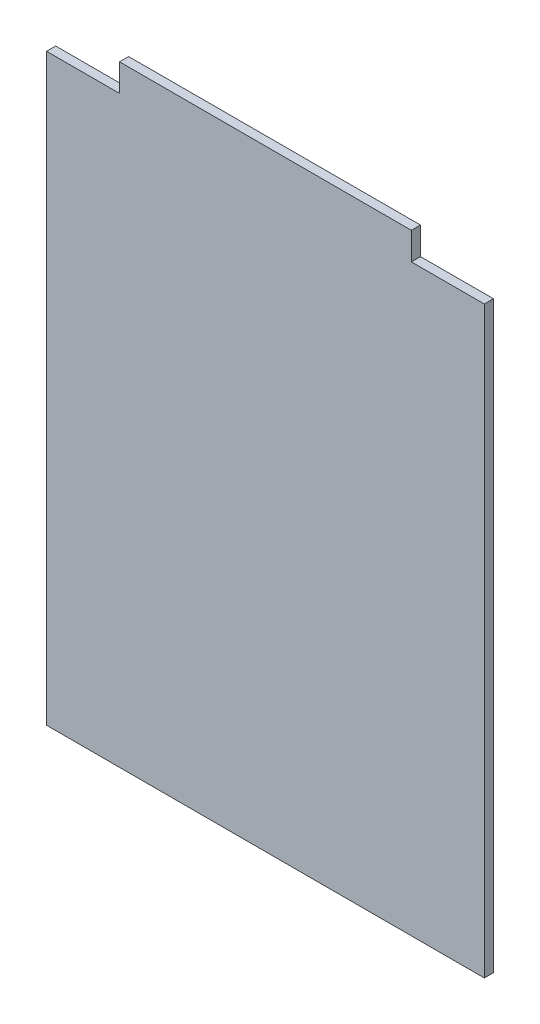
ISO-10303-21;
HEADER;
FILE_DESCRIPTION(('STEP AP214'),'2;1');
FILE_NAME('part.step','',(''),(''),'','','');
FILE_SCHEMA(('AUTOMOTIVE_DESIGN { 1 0 10303 214 1 1 1 1 }'));
ENDSEC;
DATA;
#1=APPLICATION_CONTEXT('core data for automotive mechanical design processes');
#2=APPLICATION_PROTOCOL_DEFINITION('international standard','automotive_design',2000,#1);
#3=PRODUCT_CONTEXT('',#1,'mechanical');
#4=PRODUCT('Part','Part','',(#3));
#5=PRODUCT_RELATED_PRODUCT_CATEGORY('part','',(#4));
#6=PRODUCT_DEFINITION_FORMATION('','',#4);
#7=PRODUCT_DEFINITION_CONTEXT('part definition',#1,'design');
#8=PRODUCT_DEFINITION('design','',#6,#7);
#9=PRODUCT_DEFINITION_SHAPE('','',#8);
#10=(LENGTH_UNIT() NAMED_UNIT(*) SI_UNIT(.MILLI.,.METRE.));
#11=(NAMED_UNIT(*) PLANE_ANGLE_UNIT() SI_UNIT($,.RADIAN.));
#12=(NAMED_UNIT(*) SI_UNIT($,.STERADIAN.) SOLID_ANGLE_UNIT());
#13=UNCERTAINTY_MEASURE_WITH_UNIT(LENGTH_MEASURE(1.E-05),#10,'distance_accuracy_value','');
#14=(GEOMETRIC_REPRESENTATION_CONTEXT(3) GLOBAL_UNCERTAINTY_ASSIGNED_CONTEXT((#13)) GLOBAL_UNIT_ASSIGNED_CONTEXT((#10,
#11,#12)) REPRESENTATION_CONTEXT('',''));
#15=CARTESIAN_POINT('',(0.,0.,0.));
#16=DIRECTION('',(0.,0.,1.));
#17=DIRECTION('',(1.,0.,0.));
#18=AXIS2_PLACEMENT_3D('',#15,#16,#17);
#19=CARTESIAN_POINT('',(-290.,335.,10.));
#20=DIRECTION('',(1.,0.,0.));
#21=DIRECTION('',(0.,1.,0.));
#22=AXIS2_PLACEMENT_3D('',#19,#20,#21);
#23=PLANE('',#22);
#24=DIRECTION('',(0.,-1.,0.));
#25=VECTOR('',#24,1.);
#26=CARTESIAN_POINT('',(-290.,335.,10.));
#27=LINE('',#26,#25);
#28=CARTESIAN_POINT('',(-290.,305.,10.));
#29=VERTEX_POINT('',#28);
#30=CARTESIAN_POINT('',(-290.,-335.,10.));
#31=VERTEX_POINT('',#30);
#32=EDGE_CURVE('E137',#29,#31,#27,.T.);
#33=ORIENTED_EDGE('',*,*,#32,.F.);
#34=DIRECTION('',(0.,0.,-1.));
#35=VECTOR('',#34,1.);
#36=CARTESIAN_POINT('',(-290.,305.,10.));
#37=LINE('',#36,#35);
#38=CARTESIAN_POINT('',(-290.,305.,0.));
#39=VERTEX_POINT('',#38);
#40=EDGE_CURVE('E151',#29,#39,#37,.T.);
#41=ORIENTED_EDGE('',*,*,#40,.T.);
#42=DIRECTION('',(0.,-1.,0.));
#43=VECTOR('',#42,1.);
#44=CARTESIAN_POINT('',(-290.,335.,0.));
#45=LINE('',#44,#43);
#46=CARTESIAN_POINT('',(-290.,-335.,0.));
#47=VERTEX_POINT('',#46);
#48=EDGE_CURVE('E129',#39,#47,#45,.T.);
#49=ORIENTED_EDGE('',*,*,#48,.T.);
#50=DIRECTION('',(0.,0.,-1.));
#51=VECTOR('',#50,1.);
#52=CARTESIAN_POINT('',(-290.,-335.,10.));
#53=LINE('',#52,#51);
#54=EDGE_CURVE('E11',#31,#47,#53,.T.);
#55=ORIENTED_EDGE('',*,*,#54,.F.);
#56=EDGE_LOOP('',(#33,#41,#49,#55));
#57=FACE_BOUND('',#56,.T.);
#58=ADVANCED_FACE('F33',(#57),#23,.F.);
#59=CARTESIAN_POINT('',(-290.,-335.,10.));
#60=DIRECTION('',(0.,1.,0.));
#61=DIRECTION('',(0.,0.,1.));
#62=AXIS2_PLACEMENT_3D('',#59,#60,#61);
#63=PLANE('',#62);
#64=DIRECTION('',(1.,0.,0.));
#65=VECTOR('',#64,1.);
#66=CARTESIAN_POINT('',(-290.,-335.,0.));
#67=LINE('',#66,#65);
#68=CARTESIAN_POINT('',(190.,-335.,0.));
#69=VERTEX_POINT('',#68);
#70=EDGE_CURVE('E131',#47,#69,#67,.T.);
#71=ORIENTED_EDGE('',*,*,#70,.T.);
#72=DIRECTION('',(0.,0.,-1.));
#73=VECTOR('',#72,1.);
#74=CARTESIAN_POINT('',(190.,-335.,10.));
#75=LINE('',#74,#73);
#76=CARTESIAN_POINT('',(190.,-335.,10.));
#77=VERTEX_POINT('',#76);
#78=EDGE_CURVE('E40',#77,#69,#75,.T.);
#79=ORIENTED_EDGE('',*,*,#78,.F.);
#80=DIRECTION('',(1.,0.,0.));
#81=VECTOR('',#80,1.);
#82=CARTESIAN_POINT('',(-290.,-335.,10.));
#83=LINE('',#82,#81);
#84=EDGE_CURVE('E125',#31,#77,#83,.T.);
#85=ORIENTED_EDGE('',*,*,#84,.F.);
#86=ORIENTED_EDGE('',*,*,#54,.T.);
#87=EDGE_LOOP('',(#71,#79,#85,#86));
#88=FACE_BOUND('',#87,.T.);
#89=ADVANCED_FACE('F166',(#88),#63,.F.);
#90=CARTESIAN_POINT('',(190.,335.,10.));
#91=DIRECTION('',(-1.,0.,0.));
#92=DIRECTION('',(0.,-1.,0.));
#93=AXIS2_PLACEMENT_3D('',#90,#91,#92);
#94=PLANE('',#93);
#95=DIRECTION('',(0.,1.,0.));
#96=VECTOR('',#95,1.);
#97=CARTESIAN_POINT('',(190.,335.,0.));
#98=LINE('',#97,#96);
#99=CARTESIAN_POINT('',(190.,305.,0.));
#100=VERTEX_POINT('',#99);
#101=EDGE_CURVE('E134',#69,#100,#98,.T.);
#102=ORIENTED_EDGE('',*,*,#101,.T.);
#103=DIRECTION('',(0.,0.,-1.));
#104=VECTOR('',#103,1.);
#105=CARTESIAN_POINT('',(190.,305.,10.));
#106=LINE('',#105,#104);
#107=CARTESIAN_POINT('',(190.,305.,10.));
#108=VERTEX_POINT('',#107);
#109=EDGE_CURVE('E55',#108,#100,#106,.T.);
#110=ORIENTED_EDGE('',*,*,#109,.F.);
#111=DIRECTION('',(0.,1.,0.));
#112=VECTOR('',#111,1.);
#113=CARTESIAN_POINT('',(190.,335.,10.));
#114=LINE('',#113,#112);
#115=EDGE_CURVE('E121',#77,#108,#114,.T.);
#116=ORIENTED_EDGE('',*,*,#115,.F.);
#117=ORIENTED_EDGE('',*,*,#78,.T.);
#118=EDGE_LOOP('',(#102,#110,#116,#117));
#119=FACE_BOUND('',#118,.T.);
#120=ADVANCED_FACE('F170',(#119),#94,.F.);
#121=CARTESIAN_POINT('',(-290.,335.,10.));
#122=DIRECTION('',(0.,-1.,0.));
#123=DIRECTION('',(0.,0.,-1.));
#124=AXIS2_PLACEMENT_3D('',#121,#122,#123);
#125=PLANE('',#124);
#126=DIRECTION('',(-1.,0.,0.));
#127=VECTOR('',#126,1.);
#128=CARTESIAN_POINT('',(-290.,335.,0.));
#129=LINE('',#128,#127);
#130=CARTESIAN_POINT('',(110.,335.,0.));
#131=VERTEX_POINT('',#130);
#132=CARTESIAN_POINT('',(-210.,335.,0.));
#133=VERTEX_POINT('',#132);
#134=EDGE_CURVE('E114',#131,#133,#129,.T.);
#135=ORIENTED_EDGE('',*,*,#134,.T.);
#136=DIRECTION('',(0.,0.,-1.));
#137=VECTOR('',#136,1.);
#138=CARTESIAN_POINT('',(-210.,335.,10.));
#139=LINE('',#138,#137);
#140=CARTESIAN_POINT('',(-210.,335.,10.));
#141=VERTEX_POINT('',#140);
#142=EDGE_CURVE('E47',#141,#133,#139,.T.);
#143=ORIENTED_EDGE('',*,*,#142,.F.);
#144=DIRECTION('',(-1.,0.,0.));
#145=VECTOR('',#144,1.);
#146=CARTESIAN_POINT('',(-290.,335.,10.));
#147=LINE('',#146,#145);
#148=CARTESIAN_POINT('',(110.,335.,10.));
#149=VERTEX_POINT('',#148);
#150=EDGE_CURVE('E112',#149,#141,#147,.T.);
#151=ORIENTED_EDGE('',*,*,#150,.F.);
#152=DIRECTION('',(0.,0.,-1.));
#153=VECTOR('',#152,1.);
#154=CARTESIAN_POINT('',(110.,335.,10.));
#155=LINE('',#154,#153);
#156=EDGE_CURVE('E132',#149,#131,#155,.T.);
#157=ORIENTED_EDGE('',*,*,#156,.T.);
#158=EDGE_LOOP('',(#135,#143,#151,#157));
#159=FACE_BOUND('',#158,.T.);
#160=ADVANCED_FACE('F110',(#159),#125,.F.);
#161=CARTESIAN_POINT('',(0.,0.,10.));
#162=DIRECTION('',(0.,0.,1.));
#163=DIRECTION('',(1.,0.,0.));
#164=AXIS2_PLACEMENT_3D('',#161,#162,#163);
#165=PLANE('',#164);
#166=DIRECTION('',(-1.,0.,0.));
#167=VECTOR('',#166,1.);
#168=CARTESIAN_POINT('',(-290.,305.,10.));
#169=LINE('',#168,#167);
#170=CARTESIAN_POINT('',(-210.,305.,10.));
#171=VERTEX_POINT('',#170);
#172=EDGE_CURVE('E104',#171,#29,#169,.T.);
#173=ORIENTED_EDGE('',*,*,#172,.T.);
#174=ORIENTED_EDGE('',*,*,#32,.T.);
#175=ORIENTED_EDGE('',*,*,#84,.T.);
#176=ORIENTED_EDGE('',*,*,#115,.T.);
#177=DIRECTION('',(-1.,0.,0.));
#178=VECTOR('',#177,1.);
#179=CARTESIAN_POINT('',(190.,305.,10.));
#180=LINE('',#179,#178);
#181=CARTESIAN_POINT('',(110.,305.,10.));
#182=VERTEX_POINT('',#181);
#183=EDGE_CURVE('E148',#108,#182,#180,.T.);
#184=ORIENTED_EDGE('',*,*,#183,.T.);
#185=DIRECTION('',(0.,1.,0.));
#186=VECTOR('',#185,1.);
#187=CARTESIAN_POINT('',(110.,335.,10.));
#188=LINE('',#187,#186);
#189=EDGE_CURVE('E120',#182,#149,#188,.T.);
#190=ORIENTED_EDGE('',*,*,#189,.T.);
#191=ORIENTED_EDGE('',*,*,#150,.T.);
#192=DIRECTION('',(0.,-1.,0.));
#193=VECTOR('',#192,1.);
#194=CARTESIAN_POINT('',(-210.,335.,10.));
#195=LINE('',#194,#193);
#196=EDGE_CURVE('E97',#141,#171,#195,.T.);
#197=ORIENTED_EDGE('',*,*,#196,.T.);
#198=EDGE_LOOP('',(#173,#174,#175,#176,#184,#190,#191,#197));
#199=FACE_BOUND('',#198,.T.);
#200=ADVANCED_FACE('F117',(#199),#165,.T.);
#201=CARTESIAN_POINT('',(0.,0.,0.));
#202=DIRECTION('',(0.,0.,1.));
#203=DIRECTION('',(1.,0.,0.));
#204=AXIS2_PLACEMENT_3D('',#201,#202,#203);
#205=PLANE('',#204);
#206=ORIENTED_EDGE('',*,*,#48,.F.);
#207=DIRECTION('',(-1.,0.,0.));
#208=VECTOR('',#207,1.);
#209=CARTESIAN_POINT('',(-290.,305.,0.));
#210=LINE('',#209,#208);
#211=CARTESIAN_POINT('',(-210.,305.,0.));
#212=VERTEX_POINT('',#211);
#213=EDGE_CURVE('E105',#212,#39,#210,.T.);
#214=ORIENTED_EDGE('',*,*,#213,.F.);
#215=DIRECTION('',(0.,-1.,0.));
#216=VECTOR('',#215,1.);
#217=CARTESIAN_POINT('',(-210.,335.,0.));
#218=LINE('',#217,#216);
#219=EDGE_CURVE('E158',#133,#212,#218,.T.);
#220=ORIENTED_EDGE('',*,*,#219,.F.);
#221=ORIENTED_EDGE('',*,*,#134,.F.);
#222=DIRECTION('',(0.,1.,0.));
#223=VECTOR('',#222,1.);
#224=CARTESIAN_POINT('',(110.,335.,0.));
#225=LINE('',#224,#223);
#226=CARTESIAN_POINT('',(110.,305.,0.));
#227=VERTEX_POINT('',#226);
#228=EDGE_CURVE('E146',#227,#131,#225,.T.);
#229=ORIENTED_EDGE('',*,*,#228,.F.);
#230=DIRECTION('',(-1.,0.,0.));
#231=VECTOR('',#230,1.);
#232=CARTESIAN_POINT('',(190.,305.,0.));
#233=LINE('',#232,#231);
#234=EDGE_CURVE('E149',#100,#227,#233,.T.);
#235=ORIENTED_EDGE('',*,*,#234,.F.);
#236=ORIENTED_EDGE('',*,*,#101,.F.);
#237=ORIENTED_EDGE('',*,*,#70,.F.);
#238=EDGE_LOOP('',(#206,#214,#220,#221,#229,#235,#236,#237));
#239=FACE_BOUND('',#238,.T.);
#240=ADVANCED_FACE('F173',(#239),#205,.F.);
#241=CARTESIAN_POINT('',(110.,335.,10.));
#242=DIRECTION('',(-1.,0.,0.));
#243=DIRECTION('',(0.,0.,1.));
#244=AXIS2_PLACEMENT_3D('',#241,#242,#243);
#245=PLANE('',#244);
#246=ORIENTED_EDGE('',*,*,#228,.T.);
#247=ORIENTED_EDGE('',*,*,#156,.F.);
#248=ORIENTED_EDGE('',*,*,#189,.F.);
#249=DIRECTION('',(0.,0.,-1.));
#250=VECTOR('',#249,1.);
#251=CARTESIAN_POINT('',(110.,305.,10.));
#252=LINE('',#251,#250);
#253=EDGE_CURVE('E143',#182,#227,#252,.T.);
#254=ORIENTED_EDGE('',*,*,#253,.T.);
#255=EDGE_LOOP('',(#246,#247,#248,#254));
#256=FACE_BOUND('',#255,.T.);
#257=ADVANCED_FACE('F177',(#256),#245,.F.);
#258=CARTESIAN_POINT('',(190.,305.,10.));
#259=DIRECTION('',(0.,-1.,0.));
#260=DIRECTION('',(1.,0.,0.));
#261=AXIS2_PLACEMENT_3D('',#258,#259,#260);
#262=PLANE('',#261);
#263=ORIENTED_EDGE('',*,*,#234,.T.);
#264=ORIENTED_EDGE('',*,*,#253,.F.);
#265=ORIENTED_EDGE('',*,*,#183,.F.);
#266=ORIENTED_EDGE('',*,*,#109,.T.);
#267=EDGE_LOOP('',(#263,#264,#265,#266));
#268=FACE_BOUND('',#267,.T.);
#269=ADVANCED_FACE('F175',(#268),#262,.F.);
#270=CARTESIAN_POINT('',(-290.,305.,10.));
#271=DIRECTION('',(0.,-1.,0.));
#272=DIRECTION('',(0.,0.,-1.));
#273=AXIS2_PLACEMENT_3D('',#270,#271,#272);
#274=PLANE('',#273);
#275=ORIENTED_EDGE('',*,*,#213,.T.);
#276=ORIENTED_EDGE('',*,*,#40,.F.);
#277=ORIENTED_EDGE('',*,*,#172,.F.);
#278=DIRECTION('',(0.,0.,-1.));
#279=VECTOR('',#278,1.);
#280=CARTESIAN_POINT('',(-210.,305.,10.));
#281=LINE('',#280,#279);
#282=EDGE_CURVE('E99',#171,#212,#281,.T.);
#283=ORIENTED_EDGE('',*,*,#282,.T.);
#284=EDGE_LOOP('',(#275,#276,#277,#283));
#285=FACE_BOUND('',#284,.T.);
#286=ADVANCED_FACE('F179',(#285),#274,.F.);
#287=CARTESIAN_POINT('',(-210.,335.,10.));
#288=DIRECTION('',(1.,0.,0.));
#289=DIRECTION('',(0.,0.,-1.));
#290=AXIS2_PLACEMENT_3D('',#287,#288,#289);
#291=PLANE('',#290);
#292=ORIENTED_EDGE('',*,*,#219,.T.);
#293=ORIENTED_EDGE('',*,*,#282,.F.);
#294=ORIENTED_EDGE('',*,*,#196,.F.);
#295=ORIENTED_EDGE('',*,*,#142,.T.);
#296=EDGE_LOOP('',(#292,#293,#294,#295));
#297=FACE_BOUND('',#296,.T.);
#298=ADVANCED_FACE('F98',(#297),#291,.F.);
#299=CLOSED_SHELL('',(#58,#89,#120,#160,#200,#240,#257,#269,#286,#298));
#300=MANIFOLD_SOLID_BREP('B2',#299);
#301=ADVANCED_BREP_SHAPE_REPRESENTATION('',(#18,#300),#14);
#302=SHAPE_DEFINITION_REPRESENTATION(#9,#301);
ENDSEC;
END-ISO-10303-21;
